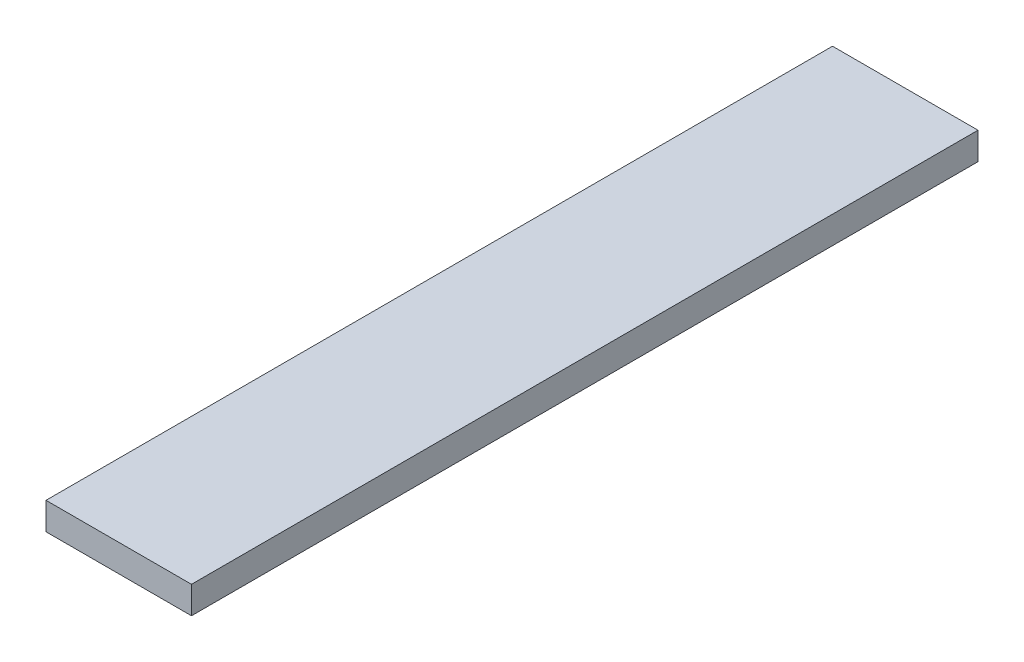
ISO-10303-21;
HEADER;
FILE_DESCRIPTION(('STEP AP214'),'2;1');
FILE_NAME('part.step','',(''),(''),'','','');
FILE_SCHEMA(('AUTOMOTIVE_DESIGN { 1 0 10303 214 1 1 1 1 }'));
ENDSEC;
DATA;
#1=APPLICATION_CONTEXT('core data for automotive mechanical design processes');
#2=APPLICATION_PROTOCOL_DEFINITION('international standard','automotive_design',2000,#1);
#3=PRODUCT_CONTEXT('',#1,'mechanical');
#4=PRODUCT('Part','Part','',(#3));
#5=PRODUCT_RELATED_PRODUCT_CATEGORY('part','',(#4));
#6=PRODUCT_DEFINITION_FORMATION('','',#4);
#7=PRODUCT_DEFINITION_CONTEXT('part definition',#1,'design');
#8=PRODUCT_DEFINITION('design','',#6,#7);
#9=PRODUCT_DEFINITION_SHAPE('','',#8);
#10=(LENGTH_UNIT() NAMED_UNIT(*) SI_UNIT(.MILLI.,.METRE.));
#11=(NAMED_UNIT(*) PLANE_ANGLE_UNIT() SI_UNIT($,.RADIAN.));
#12=(NAMED_UNIT(*) SI_UNIT($,.STERADIAN.) SOLID_ANGLE_UNIT());
#13=UNCERTAINTY_MEASURE_WITH_UNIT(LENGTH_MEASURE(1.E-05),#10,'distance_accuracy_value','');
#14=(GEOMETRIC_REPRESENTATION_CONTEXT(3) GLOBAL_UNCERTAINTY_ASSIGNED_CONTEXT((#13)) GLOBAL_UNIT_ASSIGNED_CONTEXT((#10,
#11,#12)) REPRESENTATION_CONTEXT('',''));
#15=CARTESIAN_POINT('',(0.,0.,0.));
#16=DIRECTION('',(0.,0.,1.));
#17=DIRECTION('',(1.,0.,0.));
#18=AXIS2_PLACEMENT_3D('',#15,#16,#17);
#19=CARTESIAN_POINT('',(101.6,19.05,0.));
#20=DIRECTION('',(0.,1.,0.));
#21=DIRECTION('',(0.,0.,1.));
#22=AXIS2_PLACEMENT_3D('',#19,#20,#21);
#23=PLANE('',#22);
#24=DIRECTION('',(0.,0.,-1.));
#25=VECTOR('',#24,1.);
#26=CARTESIAN_POINT('',(101.6,19.05,0.));
#27=LINE('',#26,#25);
#28=CARTESIAN_POINT('',(101.6,19.05,0.));
#29=VERTEX_POINT('',#28);
#30=CARTESIAN_POINT('',(101.6,19.05,549.275));
#31=VERTEX_POINT('',#30);
#32=EDGE_CURVE('E19',#29,#31,#27,.F.);
#33=ORIENTED_EDGE('',*,*,#32,.F.);
#34=DIRECTION('',(1.,0.,0.));
#35=VECTOR('',#34,1.);
#36=CARTESIAN_POINT('',(0.,19.05,0.));
#37=LINE('',#36,#35);
#38=CARTESIAN_POINT('',(0.,19.05,0.));
#39=VERTEX_POINT('',#38);
#40=EDGE_CURVE('E79',#29,#39,#37,.F.);
#41=ORIENTED_EDGE('',*,*,#40,.T.);
#42=DIRECTION('',(0.,0.,1.));
#43=VECTOR('',#42,1.);
#44=CARTESIAN_POINT('',(0.,19.05,0.));
#45=LINE('',#44,#43);
#46=CARTESIAN_POINT('',(0.,19.05,549.275));
#47=VERTEX_POINT('',#46);
#48=EDGE_CURVE('E67',#47,#39,#45,.F.);
#49=ORIENTED_EDGE('',*,*,#48,.F.);
#50=DIRECTION('',(1.,0.,0.));
#51=VECTOR('',#50,1.);
#52=CARTESIAN_POINT('',(0.,19.05,549.275));
#53=LINE('',#52,#51);
#54=EDGE_CURVE('E55',#31,#47,#53,.F.);
#55=ORIENTED_EDGE('',*,*,#54,.F.);
#56=EDGE_LOOP('',(#33,#41,#49,#55));
#57=FACE_BOUND('',#56,.T.);
#58=ADVANCED_FACE('F16',(#57),#23,.T.);
#59=CARTESIAN_POINT('',(101.6,0.,0.));
#60=DIRECTION('',(1.,0.,0.));
#61=DIRECTION('',(0.,0.,-1.));
#62=AXIS2_PLACEMENT_3D('',#59,#60,#61);
#63=PLANE('',#62);
#64=DIRECTION('',(0.,0.,-1.));
#65=VECTOR('',#64,1.);
#66=CARTESIAN_POINT('',(101.6,0.,0.));
#67=LINE('',#66,#65);
#68=CARTESIAN_POINT('',(101.6,0.,0.));
#69=VERTEX_POINT('',#68);
#70=CARTESIAN_POINT('',(101.6,0.,549.275));
#71=VERTEX_POINT('',#70);
#72=EDGE_CURVE('E82',#69,#71,#67,.F.);
#73=ORIENTED_EDGE('',*,*,#72,.F.);
#74=DIRECTION('',(0.,1.,0.));
#75=VECTOR('',#74,1.);
#76=CARTESIAN_POINT('',(101.6,0.,0.));
#77=LINE('',#76,#75);
#78=EDGE_CURVE('E64',#69,#29,#77,.T.);
#79=ORIENTED_EDGE('',*,*,#78,.T.);
#80=ORIENTED_EDGE('',*,*,#32,.T.);
#81=DIRECTION('',(0.,1.,0.));
#82=VECTOR('',#81,1.);
#83=CARTESIAN_POINT('',(101.6,0.,549.275));
#84=LINE('',#83,#82);
#85=EDGE_CURVE('E61',#71,#31,#84,.T.);
#86=ORIENTED_EDGE('',*,*,#85,.F.);
#87=EDGE_LOOP('',(#73,#79,#80,#86));
#88=FACE_BOUND('',#87,.T.);
#89=ADVANCED_FACE('F60',(#88),#63,.T.);
#90=CARTESIAN_POINT('',(0.,0.,549.275));
#91=DIRECTION('',(0.,0.,1.));
#92=DIRECTION('',(1.,0.,0.));
#93=AXIS2_PLACEMENT_3D('',#90,#91,#92);
#94=PLANE('',#93);
#95=DIRECTION('',(0.,1.,0.));
#96=VECTOR('',#95,1.);
#97=CARTESIAN_POINT('',(0.,19.05,549.275));
#98=LINE('',#97,#96);
#99=CARTESIAN_POINT('',(0.,0.,549.275));
#100=VERTEX_POINT('',#99);
#101=EDGE_CURVE('E69',#100,#47,#98,.T.);
#102=ORIENTED_EDGE('',*,*,#101,.F.);
#103=DIRECTION('',(1.,0.,0.));
#104=VECTOR('',#103,1.);
#105=CARTESIAN_POINT('',(0.,0.,549.275));
#106=LINE('',#105,#104);
#107=EDGE_CURVE('E73',#71,#100,#106,.F.);
#108=ORIENTED_EDGE('',*,*,#107,.F.);
#109=ORIENTED_EDGE('',*,*,#85,.T.);
#110=ORIENTED_EDGE('',*,*,#54,.T.);
#111=EDGE_LOOP('',(#102,#108,#109,#110));
#112=FACE_BOUND('',#111,.T.);
#113=ADVANCED_FACE('F71',(#112),#94,.T.);
#114=CARTESIAN_POINT('',(0.,19.05,0.));
#115=DIRECTION('',(-1.,0.,0.));
#116=DIRECTION('',(0.,0.,1.));
#117=AXIS2_PLACEMENT_3D('',#114,#115,#116);
#118=PLANE('',#117);
#119=ORIENTED_EDGE('',*,*,#48,.T.);
#120=DIRECTION('',(0.,1.,0.));
#121=VECTOR('',#120,1.);
#122=CARTESIAN_POINT('',(0.,0.,0.));
#123=LINE('',#122,#121);
#124=CARTESIAN_POINT('',(0.,0.,0.));
#125=VERTEX_POINT('',#124);
#126=EDGE_CURVE('E34',#39,#125,#123,.F.);
#127=ORIENTED_EDGE('',*,*,#126,.T.);
#128=DIRECTION('',(0.,0.,-1.));
#129=VECTOR('',#128,1.);
#130=CARTESIAN_POINT('',(0.,0.,0.));
#131=LINE('',#130,#129);
#132=EDGE_CURVE('E25',#100,#125,#131,.T.);
#133=ORIENTED_EDGE('',*,*,#132,.F.);
#134=ORIENTED_EDGE('',*,*,#101,.T.);
#135=EDGE_LOOP('',(#119,#127,#133,#134));
#136=FACE_BOUND('',#135,.T.);
#137=ADVANCED_FACE('F88',(#136),#118,.T.);
#138=CARTESIAN_POINT('',(0.,0.,0.));
#139=DIRECTION('',(0.,0.,1.));
#140=DIRECTION('',(1.,0.,0.));
#141=AXIS2_PLACEMENT_3D('',#138,#139,#140);
#142=PLANE('',#141);
#143=ORIENTED_EDGE('',*,*,#40,.F.);
#144=ORIENTED_EDGE('',*,*,#78,.F.);
#145=DIRECTION('',(1.,0.,0.));
#146=VECTOR('',#145,1.);
#147=CARTESIAN_POINT('',(0.,0.,0.));
#148=LINE('',#147,#146);
#149=EDGE_CURVE('E11',#125,#69,#148,.T.);
#150=ORIENTED_EDGE('',*,*,#149,.F.);
#151=ORIENTED_EDGE('',*,*,#126,.F.);
#152=EDGE_LOOP('',(#143,#144,#150,#151));
#153=FACE_BOUND('',#152,.T.);
#154=ADVANCED_FACE('F90',(#153),#142,.F.);
#155=CARTESIAN_POINT('',(0.,0.,0.));
#156=DIRECTION('',(0.,-1.,0.));
#157=DIRECTION('',(0.,0.,-1.));
#158=AXIS2_PLACEMENT_3D('',#155,#156,#157);
#159=PLANE('',#158);
#160=ORIENTED_EDGE('',*,*,#132,.T.);
#161=ORIENTED_EDGE('',*,*,#149,.T.);
#162=ORIENTED_EDGE('',*,*,#72,.T.);
#163=ORIENTED_EDGE('',*,*,#107,.T.);
#164=EDGE_LOOP('',(#160,#161,#162,#163));
#165=FACE_BOUND('',#164,.T.);
#166=ADVANCED_FACE('F87',(#165),#159,.T.);
#167=CLOSED_SHELL('',(#58,#89,#113,#137,#154,#166));
#168=MANIFOLD_SOLID_BREP('B1',#167);
#169=ADVANCED_BREP_SHAPE_REPRESENTATION('',(#18,#168),#14);
#170=SHAPE_DEFINITION_REPRESENTATION(#9,#169);
ENDSEC;
END-ISO-10303-21;
